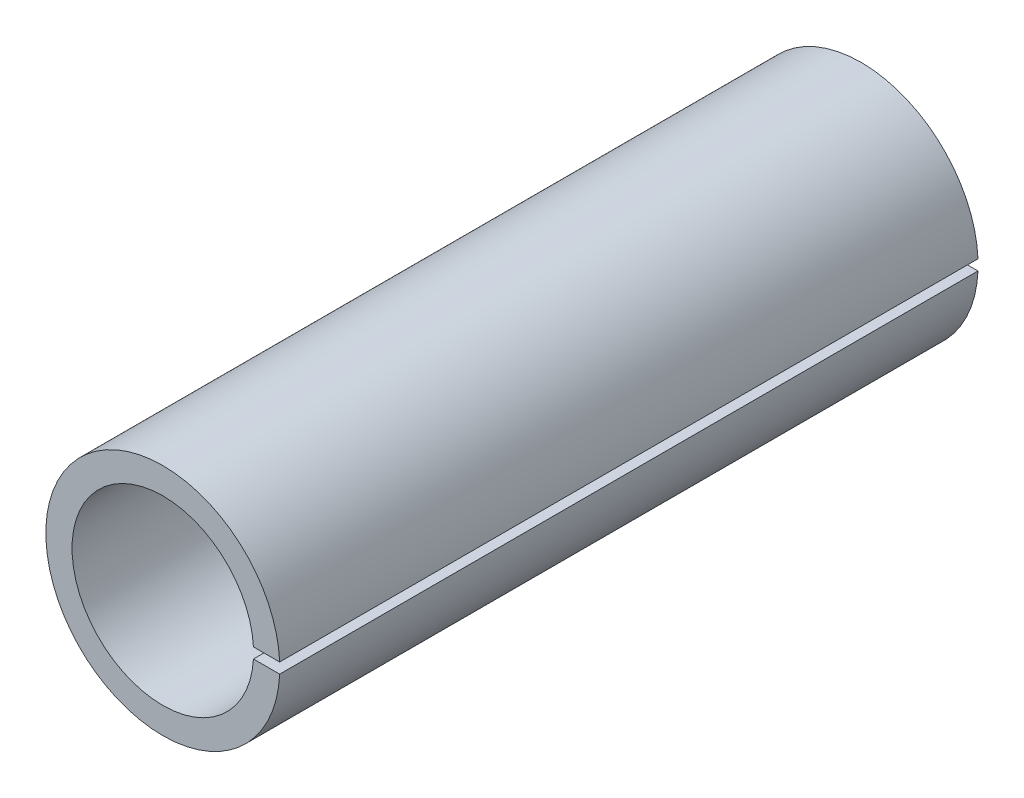
ISO-10303-21;
HEADER;
FILE_DESCRIPTION(('STEP AP214'),'2;1');
FILE_NAME('part.step','',(''),(''),'','','');
FILE_SCHEMA(('AUTOMOTIVE_DESIGN { 1 0 10303 214 1 1 1 1 }'));
ENDSEC;
DATA;
#1=APPLICATION_CONTEXT('core data for automotive mechanical design processes');
#2=APPLICATION_PROTOCOL_DEFINITION('international standard','automotive_design',2000,#1);
#3=PRODUCT_CONTEXT('',#1,'mechanical');
#4=PRODUCT('Part','Part','',(#3));
#5=PRODUCT_RELATED_PRODUCT_CATEGORY('part','',(#4));
#6=PRODUCT_DEFINITION_FORMATION('','',#4);
#7=PRODUCT_DEFINITION_CONTEXT('part definition',#1,'design');
#8=PRODUCT_DEFINITION('design','',#6,#7);
#9=PRODUCT_DEFINITION_SHAPE('','',#8);
#10=(LENGTH_UNIT() NAMED_UNIT(*) SI_UNIT(.MILLI.,.METRE.));
#11=(NAMED_UNIT(*) PLANE_ANGLE_UNIT() SI_UNIT($,.RADIAN.));
#12=(NAMED_UNIT(*) SI_UNIT($,.STERADIAN.) SOLID_ANGLE_UNIT());
#13=UNCERTAINTY_MEASURE_WITH_UNIT(LENGTH_MEASURE(1.E-05),#10,'distance_accuracy_value','');
#14=(GEOMETRIC_REPRESENTATION_CONTEXT(3) GLOBAL_UNCERTAINTY_ASSIGNED_CONTEXT((#13)) GLOBAL_UNIT_ASSIGNED_CONTEXT((#10,
#11,#12)) REPRESENTATION_CONTEXT('',''));
#15=CARTESIAN_POINT('',(0.,0.,0.));
#16=DIRECTION('',(0.,0.,1.));
#17=DIRECTION('',(1.,0.,0.));
#18=AXIS2_PLACEMENT_3D('',#15,#16,#17);
#19=CARTESIAN_POINT('',(0.,0.,12.7));
#20=DIRECTION('',(0.,0.,-1.));
#21=DIRECTION('',(-1.,0.,0.));
#22=AXIS2_PLACEMENT_3D('',#19,#20,#21);
#23=CYLINDRICAL_SURFACE('',#22,4.2545);
#24=DIRECTION('',(0.,0.,-1.));
#25=VECTOR('',#24,1.);
#26=CARTESIAN_POINT('',(4.2502329347931,0.1905,12.7));
#27=LINE('',#26,#25);
#28=CARTESIAN_POINT('',(4.2502329347931,0.1905,12.7));
#29=VERTEX_POINT('',#28);
#30=CARTESIAN_POINT('',(4.2502329347931,0.1905,-12.7));
#31=VERTEX_POINT('',#30);
#32=EDGE_CURVE('E89',#29,#31,#27,.T.);
#33=ORIENTED_EDGE('',*,*,#32,.T.);
#34=CARTESIAN_POINT('',(0.,0.,-12.7));
#35=DIRECTION('',(0.,0.,1.));
#36=DIRECTION('',(1.,0.,0.));
#37=AXIS2_PLACEMENT_3D('',#34,#35,#36);
#38=CIRCLE('',#37,4.2545);
#39=CARTESIAN_POINT('',(4.2502329347931,-0.1905,-12.7));
#40=VERTEX_POINT('',#39);
#41=EDGE_CURVE('E84',#31,#40,#38,.T.);
#42=ORIENTED_EDGE('',*,*,#41,.T.);
#43=DIRECTION('',(0.,0.,-1.));
#44=VECTOR('',#43,1.);
#45=CARTESIAN_POINT('',(4.2502329347931,-0.1905,12.7));
#46=LINE('',#45,#44);
#47=CARTESIAN_POINT('',(4.2502329347931,-0.1905,12.7));
#48=VERTEX_POINT('',#47);
#49=EDGE_CURVE('E11',#48,#40,#46,.T.);
#50=ORIENTED_EDGE('',*,*,#49,.F.);
#51=CARTESIAN_POINT('',(0.,0.,12.7));
#52=DIRECTION('',(0.,0.,1.));
#53=DIRECTION('',(1.,0.,0.));
#54=AXIS2_PLACEMENT_3D('',#51,#52,#53);
#55=CIRCLE('',#54,4.2545);
#56=EDGE_CURVE('E95',#29,#48,#55,.T.);
#57=ORIENTED_EDGE('',*,*,#56,.F.);
#58=EDGE_LOOP('',(#33,#42,#50,#57));
#59=FACE_BOUND('',#58,.T.);
#60=ADVANCED_FACE('F32',(#59),#23,.T.);
#61=CARTESIAN_POINT('',(3.29650022751402,-0.1905,12.7));
#62=DIRECTION('',(0.,-1.,0.));
#63=DIRECTION('',(0.,0.,-1.));
#64=AXIS2_PLACEMENT_3D('',#61,#62,#63);
#65=PLANE('',#64);
#66=ORIENTED_EDGE('',*,*,#49,.T.);
#67=DIRECTION('',(-1.,0.,0.));
#68=VECTOR('',#67,1.);
#69=CARTESIAN_POINT('',(3.29650022751402,-0.1905,-12.7));
#70=LINE('',#69,#68);
#71=CARTESIAN_POINT('',(3.29650022751402,-0.1905,-12.7));
#72=VERTEX_POINT('',#71);
#73=EDGE_CURVE('E74',#40,#72,#70,.T.);
#74=ORIENTED_EDGE('',*,*,#73,.T.);
#75=DIRECTION('',(0.,0.,-1.));
#76=VECTOR('',#75,1.);
#77=CARTESIAN_POINT('',(3.29650022751402,-0.1905,12.7));
#78=LINE('',#77,#76);
#79=CARTESIAN_POINT('',(3.29650022751402,-0.1905,12.7));
#80=VERTEX_POINT('',#79);
#81=EDGE_CURVE('E39',#80,#72,#78,.T.);
#82=ORIENTED_EDGE('',*,*,#81,.F.);
#83=DIRECTION('',(-1.,0.,0.));
#84=VECTOR('',#83,1.);
#85=CARTESIAN_POINT('',(3.29650022751402,-0.1905,12.7));
#86=LINE('',#85,#84);
#87=EDGE_CURVE('E75',#48,#80,#86,.T.);
#88=ORIENTED_EDGE('',*,*,#87,.F.);
#89=EDGE_LOOP('',(#66,#74,#82,#88));
#90=FACE_BOUND('',#89,.T.);
#91=ADVANCED_FACE('F72',(#90),#65,.F.);
#92=CARTESIAN_POINT('',(0.,0.,12.7));
#93=DIRECTION('',(0.,0.,-1.));
#94=DIRECTION('',(-1.,0.,0.));
#95=AXIS2_PLACEMENT_3D('',#92,#93,#94);
#96=CYLINDRICAL_SURFACE('',#95,3.302);
#97=ORIENTED_EDGE('',*,*,#81,.T.);
#98=CARTESIAN_POINT('',(0.,0.,-12.7));
#99=DIRECTION('',(0.,0.,-1.));
#100=DIRECTION('',(1.,0.,0.));
#101=AXIS2_PLACEMENT_3D('',#98,#99,#100);
#102=CIRCLE('',#101,3.302);
#103=CARTESIAN_POINT('',(3.29650022751402,0.1905,-12.7));
#104=VERTEX_POINT('',#103);
#105=EDGE_CURVE('E87',#72,#104,#102,.T.);
#106=ORIENTED_EDGE('',*,*,#105,.T.);
#107=DIRECTION('',(0.,0.,-1.));
#108=VECTOR('',#107,1.);
#109=CARTESIAN_POINT('',(3.29650022751402,0.1905,12.7));
#110=LINE('',#109,#108);
#111=CARTESIAN_POINT('',(3.29650022751402,0.1905,12.7));
#112=VERTEX_POINT('',#111);
#113=EDGE_CURVE('E101',#112,#104,#110,.T.);
#114=ORIENTED_EDGE('',*,*,#113,.F.);
#115=CARTESIAN_POINT('',(0.,0.,12.7));
#116=DIRECTION('',(0.,0.,-1.));
#117=DIRECTION('',(1.,0.,0.));
#118=AXIS2_PLACEMENT_3D('',#115,#116,#117);
#119=CIRCLE('',#118,3.302);
#120=EDGE_CURVE('E51',#80,#112,#119,.T.);
#121=ORIENTED_EDGE('',*,*,#120,.F.);
#122=EDGE_LOOP('',(#97,#106,#114,#121));
#123=FACE_BOUND('',#122,.T.);
#124=ADVANCED_FACE('F103',(#123),#96,.F.);
#125=CARTESIAN_POINT('',(3.29650022751402,0.1905,12.7));
#126=DIRECTION('',(0.,1.,0.));
#127=DIRECTION('',(0.,0.,1.));
#128=AXIS2_PLACEMENT_3D('',#125,#126,#127);
#129=PLANE('',#128);
#130=ORIENTED_EDGE('',*,*,#113,.T.);
#131=DIRECTION('',(1.,0.,0.));
#132=VECTOR('',#131,1.);
#133=CARTESIAN_POINT('',(3.29650022751402,0.1905,-12.7));
#134=LINE('',#133,#132);
#135=EDGE_CURVE('E93',#104,#31,#134,.T.);
#136=ORIENTED_EDGE('',*,*,#135,.T.);
#137=ORIENTED_EDGE('',*,*,#32,.F.);
#138=DIRECTION('',(1.,0.,0.));
#139=VECTOR('',#138,1.);
#140=CARTESIAN_POINT('',(3.29650022751402,0.1905,12.7));
#141=LINE('',#140,#139);
#142=EDGE_CURVE('E46',#112,#29,#141,.T.);
#143=ORIENTED_EDGE('',*,*,#142,.F.);
#144=EDGE_LOOP('',(#130,#136,#137,#143));
#145=FACE_BOUND('',#144,.T.);
#146=ADVANCED_FACE('F105',(#145),#129,.F.);
#147=CARTESIAN_POINT('',(0.,0.,12.7));
#148=DIRECTION('',(0.,0.,1.));
#149=DIRECTION('',(1.,0.,0.));
#150=AXIS2_PLACEMENT_3D('',#147,#148,#149);
#151=PLANE('',#150);
#152=ORIENTED_EDGE('',*,*,#56,.T.);
#153=ORIENTED_EDGE('',*,*,#87,.T.);
#154=ORIENTED_EDGE('',*,*,#120,.T.);
#155=ORIENTED_EDGE('',*,*,#142,.T.);
#156=EDGE_LOOP('',(#152,#153,#154,#155));
#157=FACE_BOUND('',#156,.T.);
#158=ADVANCED_FACE('F106',(#157),#151,.T.);
#159=CARTESIAN_POINT('',(0.,0.,-12.7));
#160=DIRECTION('',(0.,0.,1.));
#161=DIRECTION('',(1.,0.,0.));
#162=AXIS2_PLACEMENT_3D('',#159,#160,#161);
#163=PLANE('',#162);
#164=ORIENTED_EDGE('',*,*,#41,.F.);
#165=ORIENTED_EDGE('',*,*,#135,.F.);
#166=ORIENTED_EDGE('',*,*,#105,.F.);
#167=ORIENTED_EDGE('',*,*,#73,.F.);
#168=EDGE_LOOP('',(#164,#165,#166,#167));
#169=FACE_BOUND('',#168,.T.);
#170=ADVANCED_FACE('F82',(#169),#163,.F.);
#171=CLOSED_SHELL('',(#60,#91,#124,#146,#158,#170));
#172=MANIFOLD_SOLID_BREP('B2',#171);
#173=ADVANCED_BREP_SHAPE_REPRESENTATION('',(#18,#172),#14);
#174=SHAPE_DEFINITION_REPRESENTATION(#9,#173);
ENDSEC;
END-ISO-10303-21;
